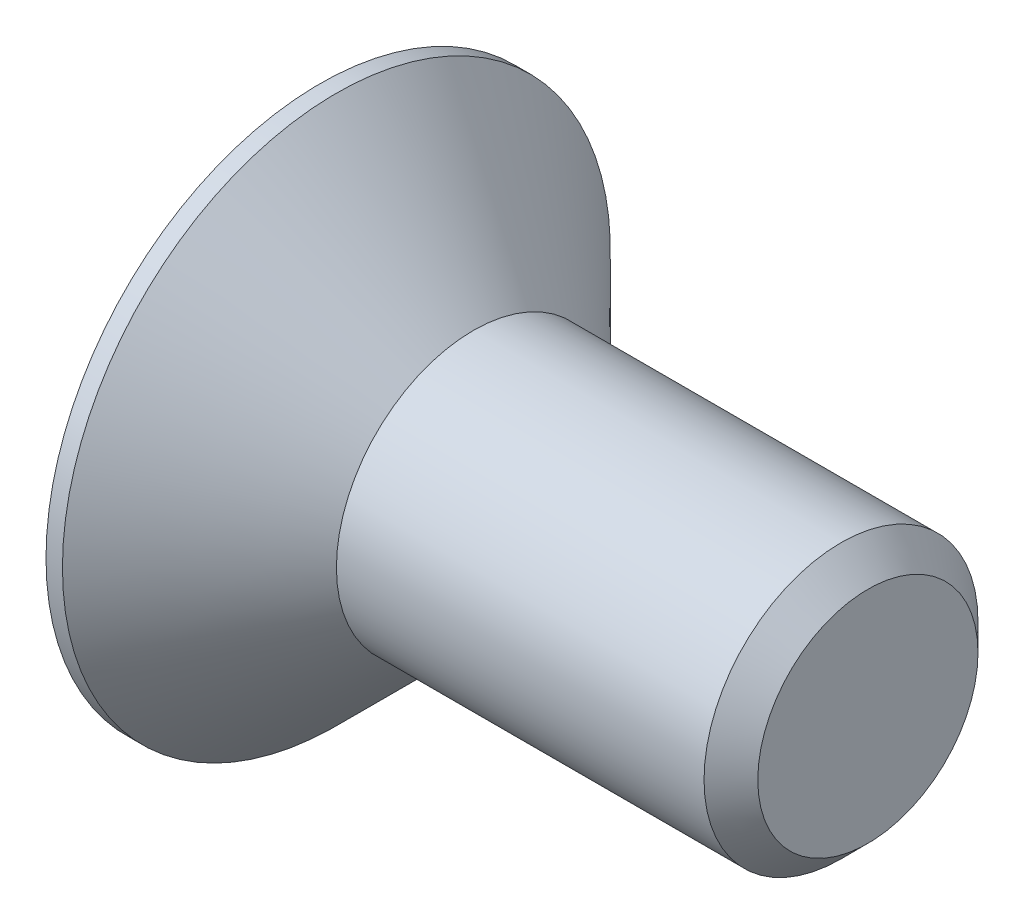
ISO-10303-21;
HEADER;
FILE_DESCRIPTION(('STEP AP214'),'2;1');
FILE_NAME('part.step','',(''),(''),'','','');
FILE_SCHEMA(('AUTOMOTIVE_DESIGN { 1 0 10303 214 1 1 1 1 }'));
ENDSEC;
DATA;
#1=APPLICATION_CONTEXT('core data for automotive mechanical design processes');
#2=APPLICATION_PROTOCOL_DEFINITION('international standard','automotive_design',2000,#1);
#3=PRODUCT_CONTEXT('',#1,'mechanical');
#4=PRODUCT('Part','Part','',(#3));
#5=PRODUCT_RELATED_PRODUCT_CATEGORY('part','',(#4));
#6=PRODUCT_DEFINITION_FORMATION('','',#4);
#7=PRODUCT_DEFINITION_CONTEXT('part definition',#1,'design');
#8=PRODUCT_DEFINITION('design','',#6,#7);
#9=PRODUCT_DEFINITION_SHAPE('','',#8);
#10=(LENGTH_UNIT() NAMED_UNIT(*) SI_UNIT(.MILLI.,.METRE.));
#11=(NAMED_UNIT(*) PLANE_ANGLE_UNIT() SI_UNIT($,.RADIAN.));
#12=(NAMED_UNIT(*) SI_UNIT($,.STERADIAN.) SOLID_ANGLE_UNIT());
#13=UNCERTAINTY_MEASURE_WITH_UNIT(LENGTH_MEASURE(1.E-05),#10,'distance_accuracy_value','');
#14=(GEOMETRIC_REPRESENTATION_CONTEXT(3) GLOBAL_UNCERTAINTY_ASSIGNED_CONTEXT((#13)) GLOBAL_UNIT_ASSIGNED_CONTEXT((#10,
#11,#12)) REPRESENTATION_CONTEXT('',''));
#15=CARTESIAN_POINT('',(0.,0.,0.));
#16=DIRECTION('',(0.,0.,1.));
#17=DIRECTION('',(1.,0.,0.));
#18=AXIS2_PLACEMENT_3D('',#15,#16,#17);
#19=CARTESIAN_POINT('',(2.24,0.,0.));
#20=DIRECTION('',(1.,0.,0.));
#21=DIRECTION('',(0.,0.,-1.));
#22=AXIS2_PLACEMENT_3D('',#19,#20,#21);
#23=PLANE('',#22);
#24=DIRECTION('',(0.,1.,0.));
#25=VECTOR('',#24,1.);
#26=CARTESIAN_POINT('',(2.24,0.866025403784439,1.5));
#27=LINE('',#26,#25);
#28=CARTESIAN_POINT('',(2.24,0.86602540378444,1.5));
#29=VERTEX_POINT('',#28);
#30=CARTESIAN_POINT('',(2.24000000001444,0.,1.49999999998226));
#31=VERTEX_POINT('',#30);
#32=EDGE_CURVE('E92',#29,#31,#27,.F.);
#33=ORIENTED_EDGE('',*,*,#32,.F.);
#34=DIRECTION('',(0.,0.5,-0.866025403784439));
#35=VECTOR('',#34,1.);
#36=CARTESIAN_POINT('',(2.24,1.73205080756888,0.));
#37=LINE('',#36,#35);
#38=CARTESIAN_POINT('',(2.24000000001444,1.2990381056613,0.749999999991132));
#39=VERTEX_POINT('',#38);
#40=EDGE_CURVE('E88',#39,#29,#37,.F.);
#41=ORIENTED_EDGE('',*,*,#40,.F.);
#42=CARTESIAN_POINT('',(2.24000000002889,0.,0.));
#43=DIRECTION('',(-1.,0.,0.));
#44=DIRECTION('',(0.,0.,1.));
#45=AXIS2_PLACEMENT_3D('',#42,#43,#44);
#46=CIRCLE('',#45,1.49999999996453);
#47=EDGE_CURVE('E20',#39,#31,#46,.F.);
#48=ORIENTED_EDGE('',*,*,#47,.T.);
#49=EDGE_LOOP('',(#33,#41,#48));
#50=FACE_BOUND('',#49,.T.);
#51=ADVANCED_FACE('F17',(#50),#23,.F.);
#52=CARTESIAN_POINT('',(2.24,0.,0.));
#53=DIRECTION('',(1.,0.,0.));
#54=DIRECTION('',(0.,0.,-1.));
#55=AXIS2_PLACEMENT_3D('',#52,#53,#54);
#56=PLANE('',#55);
#57=CARTESIAN_POINT('',(2.24000000002889,0.,0.));
#58=DIRECTION('',(-1.,0.,0.));
#59=DIRECTION('',(0.,0.,1.));
#60=AXIS2_PLACEMENT_3D('',#57,#58,#59);
#61=CIRCLE('',#60,1.49999999996453);
#62=CARTESIAN_POINT('',(2.24000000001444,1.2990381056613,-0.749999999991131));
#63=VERTEX_POINT('',#62);
#64=EDGE_CURVE('E104',#63,#39,#61,.F.);
#65=ORIENTED_EDGE('',*,*,#64,.T.);
#66=DIRECTION('',(0.,0.5,-0.866025403784439));
#67=VECTOR('',#66,1.);
#68=CARTESIAN_POINT('',(2.24,1.73205080756888,0.));
#69=LINE('',#68,#67);
#70=CARTESIAN_POINT('',(2.24,1.73205080756888,0.));
#71=VERTEX_POINT('',#70);
#72=EDGE_CURVE('E98',#71,#39,#69,.F.);
#73=ORIENTED_EDGE('',*,*,#72,.F.);
#74=DIRECTION('',(0.,-0.5,-0.866025403784439));
#75=VECTOR('',#74,1.);
#76=CARTESIAN_POINT('',(2.24,0.866025403784439,-1.5));
#77=LINE('',#76,#75);
#78=EDGE_CURVE('E114',#63,#71,#77,.F.);
#79=ORIENTED_EDGE('',*,*,#78,.F.);
#80=EDGE_LOOP('',(#65,#73,#79));
#81=FACE_BOUND('',#80,.T.);
#82=ADVANCED_FACE('F111',(#81),#56,.F.);
#83=CARTESIAN_POINT('',(2.24,1.73205080756888,0.));
#84=DIRECTION('',(0.,-0.866025403784439,-0.5));
#85=DIRECTION('',(0.,0.5,-0.866025403784439));
#86=AXIS2_PLACEMENT_3D('',#83,#84,#85);
#87=PLANE('',#86);
#88=ORIENTED_EDGE('',*,*,#40,.T.);
#89=DIRECTION('',(-1.,0.,0.));
#90=VECTOR('',#89,1.);
#91=CARTESIAN_POINT('',(2.24,0.866025403784439,1.5));
#92=LINE('',#91,#90);
#93=CARTESIAN_POINT('',(0.,0.86602540378444,1.5));
#94=VERTEX_POINT('',#93);
#95=EDGE_CURVE('E132',#94,#29,#92,.F.);
#96=ORIENTED_EDGE('',*,*,#95,.F.);
#97=DIRECTION('',(0.,0.5,-0.866025403784439));
#98=VECTOR('',#97,1.);
#99=CARTESIAN_POINT('',(0.,1.73205080756888,0.));
#100=LINE('',#99,#98);
#101=CARTESIAN_POINT('',(0.,1.73205080756888,0.));
#102=VERTEX_POINT('',#101);
#103=EDGE_CURVE('E122',#94,#102,#100,.T.);
#104=ORIENTED_EDGE('',*,*,#103,.T.);
#105=DIRECTION('',(1.,0.,0.));
#106=VECTOR('',#105,1.);
#107=CARTESIAN_POINT('',(2.24,1.73205080756888,0.));
#108=LINE('',#107,#106);
#109=EDGE_CURVE('E121',#71,#102,#108,.F.);
#110=ORIENTED_EDGE('',*,*,#109,.F.);
#111=ORIENTED_EDGE('',*,*,#72,.T.);
#112=EDGE_LOOP('',(#88,#96,#104,#110,#111));
#113=FACE_BOUND('',#112,.T.);
#114=ADVANCED_FACE('F118',(#113),#87,.T.);
#115=CARTESIAN_POINT('',(2.24,0.866025403784439,1.5));
#116=DIRECTION('',(0.,0.,-1.));
#117=DIRECTION('',(-1.,0.,0.));
#118=AXIS2_PLACEMENT_3D('',#115,#116,#117);
#119=PLANE('',#118);
#120=DIRECTION('',(0.,1.,0.));
#121=VECTOR('',#120,1.);
#122=CARTESIAN_POINT('',(2.24,0.,1.5));
#123=LINE('',#122,#121);
#124=CARTESIAN_POINT('',(2.24,-0.866025403784439,1.5));
#125=VERTEX_POINT('',#124);
#126=EDGE_CURVE('E108',#31,#125,#123,.F.);
#127=ORIENTED_EDGE('',*,*,#126,.T.);
#128=DIRECTION('',(1.,0.,0.));
#129=VECTOR('',#128,1.);
#130=CARTESIAN_POINT('',(2.24,-0.866025403784439,1.5));
#131=LINE('',#130,#129);
#132=CARTESIAN_POINT('',(0.,-0.866025403784439,1.5));
#133=VERTEX_POINT('',#132);
#134=EDGE_CURVE('E174',#133,#125,#131,.T.);
#135=ORIENTED_EDGE('',*,*,#134,.F.);
#136=DIRECTION('',(0.,1.,0.));
#137=VECTOR('',#136,1.);
#138=CARTESIAN_POINT('',(0.,0.866025403784439,1.5));
#139=LINE('',#138,#137);
#140=EDGE_CURVE('E97',#133,#94,#139,.T.);
#141=ORIENTED_EDGE('',*,*,#140,.T.);
#142=ORIENTED_EDGE('',*,*,#95,.T.);
#143=ORIENTED_EDGE('',*,*,#32,.T.);
#144=EDGE_LOOP('',(#127,#135,#141,#142,#143));
#145=FACE_BOUND('',#144,.T.);
#146=ADVANCED_FACE('F261',(#145),#119,.T.);
#147=CARTESIAN_POINT('',(2.24,0.,0.));
#148=DIRECTION('',(1.,0.,0.));
#149=DIRECTION('',(0.,0.,-1.));
#150=AXIS2_PLACEMENT_3D('',#147,#148,#149);
#151=PLANE('',#150);
#152=DIRECTION('',(0.,0.5,0.866025403784439));
#153=VECTOR('',#152,1.);
#154=CARTESIAN_POINT('',(2.24,-0.866025403784439,1.5));
#155=LINE('',#154,#153);
#156=CARTESIAN_POINT('',(2.24000000001444,-1.2990381056613,0.749999999991131));
#157=VERTEX_POINT('',#156);
#158=EDGE_CURVE('E165',#125,#157,#155,.F.);
#159=ORIENTED_EDGE('',*,*,#158,.F.);
#160=ORIENTED_EDGE('',*,*,#126,.F.);
#161=CARTESIAN_POINT('',(2.24000000002889,0.,0.));
#162=DIRECTION('',(-1.,0.,0.));
#163=DIRECTION('',(0.,0.,1.));
#164=AXIS2_PLACEMENT_3D('',#161,#162,#163);
#165=CIRCLE('',#164,1.49999999996453);
#166=EDGE_CURVE('E107',#31,#157,#165,.F.);
#167=ORIENTED_EDGE('',*,*,#166,.T.);
#168=EDGE_LOOP('',(#159,#160,#167));
#169=FACE_BOUND('',#168,.T.);
#170=ADVANCED_FACE('F164',(#169),#151,.F.);
#171=CARTESIAN_POINT('',(2.24000000002889,0.,0.));
#172=DIRECTION('',(-1.,0.,0.));
#173=DIRECTION('',(0.,0.,1.));
#174=AXIS2_PLACEMENT_3D('',#171,#172,#173);
#175=CONICAL_SURFACE('',#174,1.49999999996453,1.30899693899977);
#176=CARTESIAN_POINT('',(2.64192378864436,0.,5.6843418860808E-11));
#177=VERTEX_POINT('',#176);
#178=VERTEX_LOOP('',#177);
#179=FACE_BOUND('',#178,.T.);
#180=CARTESIAN_POINT('',(2.24000000002889,0.,0.));
#181=DIRECTION('',(-1.,0.,0.));
#182=DIRECTION('',(0.,0.,1.));
#183=AXIS2_PLACEMENT_3D('',#180,#181,#182);
#184=CIRCLE('',#183,1.49999999996453);
#185=CARTESIAN_POINT('',(2.24000000001444,0.,-1.49999999998226));
#186=VERTEX_POINT('',#185);
#187=EDGE_CURVE('E116',#63,#186,#184,.T.);
#188=ORIENTED_EDGE('',*,*,#187,.T.);
#189=CARTESIAN_POINT('',(2.24000000002889,0.,0.));
#190=DIRECTION('',(-1.,0.,0.));
#191=DIRECTION('',(0.,0.,1.));
#192=AXIS2_PLACEMENT_3D('',#189,#190,#191);
#193=CIRCLE('',#192,1.49999999996453);
#194=CARTESIAN_POINT('',(2.24000000001444,-1.2990381056613,-0.749999999991133));
#195=VERTEX_POINT('',#194);
#196=EDGE_CURVE('E156',#186,#195,#193,.T.);
#197=ORIENTED_EDGE('',*,*,#196,.T.);
#198=CARTESIAN_POINT('',(2.24000000002889,0.,0.));
#199=DIRECTION('',(-1.,0.,0.));
#200=DIRECTION('',(0.,0.,1.));
#201=AXIS2_PLACEMENT_3D('',#198,#199,#200);
#202=CIRCLE('',#201,1.49999999996453);
#203=EDGE_CURVE('E158',#195,#157,#202,.T.);
#204=ORIENTED_EDGE('',*,*,#203,.T.);
#205=ORIENTED_EDGE('',*,*,#166,.F.);
#206=ORIENTED_EDGE('',*,*,#47,.F.);
#207=ORIENTED_EDGE('',*,*,#64,.F.);
#208=EDGE_LOOP('',(#188,#197,#204,#205,#206,#207));
#209=FACE_BOUND('',#208,.T.);
#210=ADVANCED_FACE('F103',(#179,#209),#175,.F.);
#211=CARTESIAN_POINT('',(2.24,0.,0.));
#212=DIRECTION('',(1.,0.,0.));
#213=DIRECTION('',(0.,0.,-1.));
#214=AXIS2_PLACEMENT_3D('',#211,#212,#213);
#215=PLANE('',#214);
#216=DIRECTION('',(0.,-0.5,-0.866025403784439));
#217=VECTOR('',#216,1.);
#218=CARTESIAN_POINT('',(2.24,0.866025403784439,-1.5));
#219=LINE('',#218,#217);
#220=CARTESIAN_POINT('',(2.24,0.866025403784438,-1.5));
#221=VERTEX_POINT('',#220);
#222=EDGE_CURVE('E145',#221,#63,#219,.F.);
#223=ORIENTED_EDGE('',*,*,#222,.F.);
#224=DIRECTION('',(0.,1.,0.));
#225=VECTOR('',#224,1.);
#226=CARTESIAN_POINT('',(2.24,-0.866025403784439,-1.5));
#227=LINE('',#226,#225);
#228=EDGE_CURVE('E205',#186,#221,#227,.T.);
#229=ORIENTED_EDGE('',*,*,#228,.F.);
#230=ORIENTED_EDGE('',*,*,#187,.F.);
#231=EDGE_LOOP('',(#223,#229,#230));
#232=FACE_BOUND('',#231,.T.);
#233=ADVANCED_FACE('F236',(#232),#215,.F.);
#234=CARTESIAN_POINT('',(2.24,0.866025403784439,-1.5));
#235=DIRECTION('',(0.,-0.866025403784439,0.5));
#236=DIRECTION('',(0.,-0.5,-0.866025403784439));
#237=AXIS2_PLACEMENT_3D('',#234,#235,#236);
#238=PLANE('',#237);
#239=ORIENTED_EDGE('',*,*,#78,.T.);
#240=ORIENTED_EDGE('',*,*,#109,.T.);
#241=DIRECTION('',(0.,-0.5,-0.866025403784439));
#242=VECTOR('',#241,1.);
#243=CARTESIAN_POINT('',(0.,0.866025403784439,-1.5));
#244=LINE('',#243,#242);
#245=CARTESIAN_POINT('',(0.,0.866025403784438,-1.5));
#246=VERTEX_POINT('',#245);
#247=EDGE_CURVE('E142',#102,#246,#244,.T.);
#248=ORIENTED_EDGE('',*,*,#247,.T.);
#249=DIRECTION('',(1.,0.,0.));
#250=VECTOR('',#249,1.);
#251=CARTESIAN_POINT('',(2.24,0.866025403784438,-1.5));
#252=LINE('',#251,#250);
#253=EDGE_CURVE('E193',#221,#246,#252,.F.);
#254=ORIENTED_EDGE('',*,*,#253,.F.);
#255=ORIENTED_EDGE('',*,*,#222,.T.);
#256=EDGE_LOOP('',(#239,#240,#248,#254,#255));
#257=FACE_BOUND('',#256,.T.);
#258=ADVANCED_FACE('F232',(#257),#238,.T.);
#259=CARTESIAN_POINT('',(2.24,-0.866025403784439,1.5));
#260=DIRECTION('',(0.,0.866025403784439,-0.5));
#261=DIRECTION('',(0.,0.5,0.866025403784439));
#262=AXIS2_PLACEMENT_3D('',#259,#260,#261);
#263=PLANE('',#262);
#264=DIRECTION('',(0.,-0.500000000000001,-0.866025403784438));
#265=VECTOR('',#264,1.);
#266=CARTESIAN_POINT('',(2.24,-1.29903810567666,0.75));
#267=LINE('',#266,#265);
#268=CARTESIAN_POINT('',(2.24,-1.73205080756888,0.));
#269=VERTEX_POINT('',#268);
#270=EDGE_CURVE('E160',#157,#269,#267,.T.);
#271=ORIENTED_EDGE('',*,*,#270,.T.);
#272=DIRECTION('',(1.,0.,0.));
#273=VECTOR('',#272,1.);
#274=CARTESIAN_POINT('',(2.24,-1.73205080756888,0.));
#275=LINE('',#274,#273);
#276=CARTESIAN_POINT('',(0.,-1.73205080756888,0.));
#277=VERTEX_POINT('',#276);
#278=EDGE_CURVE('E191',#277,#269,#275,.T.);
#279=ORIENTED_EDGE('',*,*,#278,.F.);
#280=DIRECTION('',(0.,0.5,0.866025403784439));
#281=VECTOR('',#280,1.);
#282=CARTESIAN_POINT('',(0.,-0.866025403784439,1.5));
#283=LINE('',#282,#281);
#284=EDGE_CURVE('E196',#277,#133,#283,.T.);
#285=ORIENTED_EDGE('',*,*,#284,.T.);
#286=ORIENTED_EDGE('',*,*,#134,.T.);
#287=ORIENTED_EDGE('',*,*,#158,.T.);
#288=EDGE_LOOP('',(#271,#279,#285,#286,#287));
#289=FACE_BOUND('',#288,.T.);
#290=ADVANCED_FACE('F168',(#289),#263,.T.);
#291=CARTESIAN_POINT('',(2.24,0.,0.));
#292=DIRECTION('',(1.,0.,0.));
#293=DIRECTION('',(0.,0.,-1.));
#294=AXIS2_PLACEMENT_3D('',#291,#292,#293);
#295=PLANE('',#294);
#296=DIRECTION('',(0.,-0.5,0.866025403784439));
#297=VECTOR('',#296,1.);
#298=CARTESIAN_POINT('',(2.24,-1.73205080756888,0.));
#299=LINE('',#298,#297);
#300=EDGE_CURVE('E182',#269,#195,#299,.F.);
#301=ORIENTED_EDGE('',*,*,#300,.F.);
#302=ORIENTED_EDGE('',*,*,#270,.F.);
#303=ORIENTED_EDGE('',*,*,#203,.F.);
#304=EDGE_LOOP('',(#301,#302,#303));
#305=FACE_BOUND('',#304,.T.);
#306=ADVANCED_FACE('F180',(#305),#295,.F.);
#307=CARTESIAN_POINT('',(2.24,0.,0.));
#308=DIRECTION('',(1.,0.,0.));
#309=DIRECTION('',(0.,0.,-1.));
#310=AXIS2_PLACEMENT_3D('',#307,#308,#309);
#311=PLANE('',#310);
#312=DIRECTION('',(0.,1.,0.));
#313=VECTOR('',#312,1.);
#314=CARTESIAN_POINT('',(2.24,-0.866025403784439,-1.5));
#315=LINE('',#314,#313);
#316=CARTESIAN_POINT('',(2.24,-0.866025403784441,-1.5));
#317=VERTEX_POINT('',#316);
#318=EDGE_CURVE('E208',#317,#186,#315,.T.);
#319=ORIENTED_EDGE('',*,*,#318,.F.);
#320=DIRECTION('',(0.,-0.5,0.866025403784439));
#321=VECTOR('',#320,1.);
#322=CARTESIAN_POINT('',(2.24,-1.73205080756888,0.));
#323=LINE('',#322,#321);
#324=EDGE_CURVE('E241',#195,#317,#323,.F.);
#325=ORIENTED_EDGE('',*,*,#324,.F.);
#326=ORIENTED_EDGE('',*,*,#196,.F.);
#327=EDGE_LOOP('',(#319,#325,#326));
#328=FACE_BOUND('',#327,.T.);
#329=ADVANCED_FACE('F239',(#328),#311,.F.);
#330=CARTESIAN_POINT('',(2.24,-0.866025403784439,-1.5));
#331=DIRECTION('',(0.,0.,1.));
#332=DIRECTION('',(1.,0.,0.));
#333=AXIS2_PLACEMENT_3D('',#330,#331,#332);
#334=PLANE('',#333);
#335=ORIENTED_EDGE('',*,*,#228,.T.);
#336=ORIENTED_EDGE('',*,*,#253,.T.);
#337=DIRECTION('',(0.,1.,0.));
#338=VECTOR('',#337,1.);
#339=CARTESIAN_POINT('',(0.,-0.866025403784439,-1.5));
#340=LINE('',#339,#338);
#341=CARTESIAN_POINT('',(0.,-0.86602540378444,-1.5));
#342=VERTEX_POINT('',#341);
#343=EDGE_CURVE('E35',#246,#342,#340,.F.);
#344=ORIENTED_EDGE('',*,*,#343,.T.);
#345=DIRECTION('',(1.,0.,0.));
#346=VECTOR('',#345,1.);
#347=CARTESIAN_POINT('',(2.24,-0.866025403784441,-1.5));
#348=LINE('',#347,#346);
#349=EDGE_CURVE('E202',#317,#342,#348,.F.);
#350=ORIENTED_EDGE('',*,*,#349,.F.);
#351=ORIENTED_EDGE('',*,*,#318,.T.);
#352=EDGE_LOOP('',(#335,#336,#344,#350,#351));
#353=FACE_BOUND('',#352,.T.);
#354=ADVANCED_FACE('F255',(#353),#334,.T.);
#355=CARTESIAN_POINT('',(2.24,-1.73205080756888,0.));
#356=DIRECTION('',(0.,0.866025403784439,0.5));
#357=DIRECTION('',(0.,-0.5,0.866025403784439));
#358=AXIS2_PLACEMENT_3D('',#355,#356,#357);
#359=PLANE('',#358);
#360=ORIENTED_EDGE('',*,*,#324,.T.);
#361=ORIENTED_EDGE('',*,*,#349,.T.);
#362=DIRECTION('',(0.,-0.500000000000001,0.866025403784438));
#363=VECTOR('',#362,1.);
#364=CARTESIAN_POINT('',(0.,-0.866025403784439,-1.5));
#365=LINE('',#364,#363);
#366=EDGE_CURVE('E155',#342,#277,#365,.T.);
#367=ORIENTED_EDGE('',*,*,#366,.T.);
#368=ORIENTED_EDGE('',*,*,#278,.T.);
#369=ORIENTED_EDGE('',*,*,#300,.T.);
#370=EDGE_LOOP('',(#360,#361,#367,#368,#369));
#371=FACE_BOUND('',#370,.T.);
#372=ADVANCED_FACE('F244',(#371),#359,.T.);
#373=CARTESIAN_POINT('',(0.,0.,0.));
#374=DIRECTION('',(1.,0.,0.));
#375=DIRECTION('',(0.,0.,-1.));
#376=AXIS2_PLACEMENT_3D('',#373,#374,#375);
#377=PLANE('',#376);
#378=ORIENTED_EDGE('',*,*,#343,.F.);
#379=ORIENTED_EDGE('',*,*,#247,.F.);
#380=ORIENTED_EDGE('',*,*,#103,.F.);
#381=ORIENTED_EDGE('',*,*,#140,.F.);
#382=ORIENTED_EDGE('',*,*,#284,.F.);
#383=ORIENTED_EDGE('',*,*,#366,.F.);
#384=EDGE_LOOP('',(#378,#379,#380,#381,#382,#383));
#385=FACE_BOUND('',#384,.T.);
#386=CARTESIAN_POINT('',(0.,0.,0.));
#387=DIRECTION('',(-1.,0.,0.));
#388=DIRECTION('',(0.,0.,1.));
#389=AXIS2_PLACEMENT_3D('',#386,#387,#388);
#390=CIRCLE('',#389,5.);
#391=CARTESIAN_POINT('',(0.,0.,5.));
#392=VERTEX_POINT('',#391);
#393=EDGE_CURVE('E152',#392,#392,#390,.F.);
#394=ORIENTED_EDGE('',*,*,#393,.F.);
#395=EDGE_LOOP('',(#394));
#396=FACE_BOUND('',#395,.T.);
#397=ADVANCED_FACE('F258',(#385,#396),#377,.F.);
#398=CARTESIAN_POINT('',(10.,2.0095,0.));
#399=DIRECTION('',(-1.,0.,0.));
#400=DIRECTION('',(0.,0.,1.));
#401=AXIS2_PLACEMENT_3D('',#398,#399,#400);
#402=PLANE('',#401);
#403=CARTESIAN_POINT('',(9.99999999999091,0.,0.));
#404=DIRECTION('',(-1.,0.,0.));
#405=DIRECTION('',(0.,0.,1.));
#406=AXIS2_PLACEMENT_3D('',#403,#404,#405);
#407=CIRCLE('',#406,2.00949999998556);
#408=CARTESIAN_POINT('',(9.99999999999091,0.,2.00949999998556));
#409=VERTEX_POINT('',#408);
#410=EDGE_CURVE('E148',#409,#409,#407,.T.);
#411=ORIENTED_EDGE('',*,*,#410,.F.);
#412=EDGE_LOOP('',(#411));
#413=FACE_BOUND('',#412,.T.);
#414=ADVANCED_FACE('F290',(#413),#402,.F.);
#415=CARTESIAN_POINT('',(10.,0.,0.));
#416=DIRECTION('',(-1.,0.,0.));
#417=DIRECTION('',(0.,0.,1.));
#418=AXIS2_PLACEMENT_3D('',#415,#416,#417);
#419=CYLINDRICAL_SURFACE('',#418,5.);
#420=ORIENTED_EDGE('',*,*,#393,.T.);
#421=EDGE_LOOP('',(#420));
#422=FACE_BOUND('',#421,.T.);
#423=CARTESIAN_POINT('',(0.299999999981537,0.,0.));
#424=DIRECTION('',(-1.,0.,0.));
#425=DIRECTION('',(0.,0.,1.));
#426=AXIS2_PLACEMENT_3D('',#423,#424,#425);
#427=CIRCLE('',#426,4.99999999999545);
#428=CARTESIAN_POINT('',(0.299999999981537,0.,4.99999999999545));
#429=VERTEX_POINT('',#428);
#430=EDGE_CURVE('E151',#429,#429,#427,.F.);
#431=ORIENTED_EDGE('',*,*,#430,.F.);
#432=EDGE_LOOP('',(#431));
#433=FACE_BOUND('',#432,.T.);
#434=ADVANCED_FACE('F286',(#422,#433),#419,.T.);
#435=CARTESIAN_POINT('',(9.50950000009243,0.,0.));
#436=DIRECTION('',(-1.,0.,0.));
#437=DIRECTION('',(0.,0.,1.));
#438=AXIS2_PLACEMENT_3D('',#435,#436,#437);
#439=CONICAL_SURFACE('',#438,2.49999999988404,0.785398163397448);
#440=CARTESIAN_POINT('',(9.5095,0.,0.));
#441=DIRECTION('',(-1.,0.,0.));
#442=DIRECTION('',(0.,0.,1.));
#443=AXIS2_PLACEMENT_3D('',#440,#441,#442);
#444=CIRCLE('',#443,2.5);
#445=CARTESIAN_POINT('',(9.5095,0.,2.5));
#446=VERTEX_POINT('',#445);
#447=EDGE_CURVE('E26',#446,#446,#444,.T.);
#448=ORIENTED_EDGE('',*,*,#447,.F.);
#449=EDGE_LOOP('',(#448));
#450=FACE_BOUND('',#449,.T.);
#451=ORIENTED_EDGE('',*,*,#410,.T.);
#452=EDGE_LOOP('',(#451));
#453=FACE_BOUND('',#452,.T.);
#454=ADVANCED_FACE('F279',(#450,#453),#439,.T.);
#455=CARTESIAN_POINT('',(0.299999999981537,0.,0.));
#456=DIRECTION('',(-1.,0.,0.));
#457=DIRECTION('',(0.,0.,1.));
#458=AXIS2_PLACEMENT_3D('',#455,#456,#457);
#459=CONICAL_SURFACE('',#458,4.99999999999545,0.785398163408817);
#460=ORIENTED_EDGE('',*,*,#430,.T.);
#461=EDGE_LOOP('',(#460));
#462=FACE_BOUND('',#461,.T.);
#463=CARTESIAN_POINT('',(2.8,0.,0.));
#464=DIRECTION('',(-1.,0.,0.));
#465=DIRECTION('',(0.,0.,1.));
#466=AXIS2_PLACEMENT_3D('',#463,#464,#465);
#467=CIRCLE('',#466,2.5);
#468=CARTESIAN_POINT('',(2.8,0.,2.5));
#469=VERTEX_POINT('',#468);
#470=EDGE_CURVE('E11',#469,#469,#467,.F.);
#471=ORIENTED_EDGE('',*,*,#470,.F.);
#472=EDGE_LOOP('',(#471));
#473=FACE_BOUND('',#472,.T.);
#474=ADVANCED_FACE('F273',(#462,#473),#459,.T.);
#475=CARTESIAN_POINT('',(10.,0.,0.));
#476=DIRECTION('',(-1.,0.,0.));
#477=DIRECTION('',(0.,0.,1.));
#478=AXIS2_PLACEMENT_3D('',#475,#476,#477);
#479=CYLINDRICAL_SURFACE('',#478,2.5);
#480=ORIENTED_EDGE('',*,*,#470,.T.);
#481=EDGE_LOOP('',(#480));
#482=FACE_BOUND('',#481,.T.);
#483=ORIENTED_EDGE('',*,*,#447,.T.);
#484=EDGE_LOOP('',(#483));
#485=FACE_BOUND('',#484,.T.);
#486=ADVANCED_FACE('F271',(#482,#485),#479,.T.);
#487=CLOSED_SHELL('',(#51,#82,#114,#146,#170,#210,#233,#258,#290,#306,#329,#354,#372,#397,#414,
#434,#454,#474,#486));
#488=MANIFOLD_SOLID_BREP('B1',#487);
#489=ADVANCED_BREP_SHAPE_REPRESENTATION('',(#18,#488),#14);
#490=SHAPE_DEFINITION_REPRESENTATION(#9,#489);
ENDSEC;
END-ISO-10303-21;
